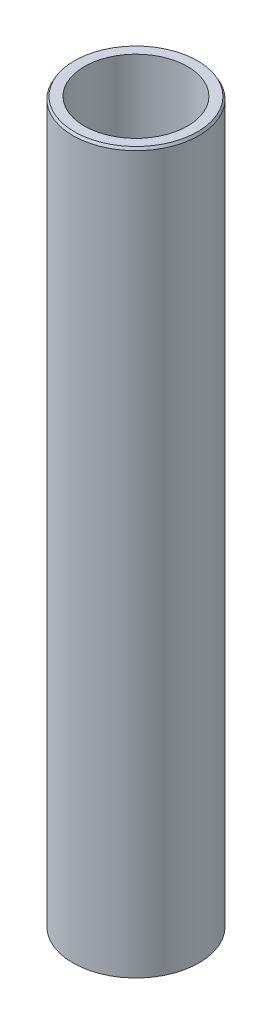
ISO-10303-21;
HEADER;
FILE_DESCRIPTION(('STEP AP214'),'2;1');
FILE_NAME('part.step','',(''),(''),'','','');
FILE_SCHEMA(('AUTOMOTIVE_DESIGN { 1 0 10303 214 1 1 1 1 }'));
ENDSEC;
DATA;
#1=APPLICATION_CONTEXT('core data for automotive mechanical design processes');
#2=APPLICATION_PROTOCOL_DEFINITION('international standard','automotive_design',2000,#1);
#3=PRODUCT_CONTEXT('',#1,'mechanical');
#4=PRODUCT('Part','Part','',(#3));
#5=PRODUCT_RELATED_PRODUCT_CATEGORY('part','',(#4));
#6=PRODUCT_DEFINITION_FORMATION('','',#4);
#7=PRODUCT_DEFINITION_CONTEXT('part definition',#1,'design');
#8=PRODUCT_DEFINITION('design','',#6,#7);
#9=PRODUCT_DEFINITION_SHAPE('','',#8);
#10=(LENGTH_UNIT() NAMED_UNIT(*) SI_UNIT(.MILLI.,.METRE.));
#11=(NAMED_UNIT(*) PLANE_ANGLE_UNIT() SI_UNIT($,.RADIAN.));
#12=(NAMED_UNIT(*) SI_UNIT($,.STERADIAN.) SOLID_ANGLE_UNIT());
#13=UNCERTAINTY_MEASURE_WITH_UNIT(LENGTH_MEASURE(1.E-05),#10,'distance_accuracy_value','');
#14=(GEOMETRIC_REPRESENTATION_CONTEXT(3) GLOBAL_UNCERTAINTY_ASSIGNED_CONTEXT((#13)) GLOBAL_UNIT_ASSIGNED_CONTEXT((#10,
#11,#12)) REPRESENTATION_CONTEXT('',''));
#15=CARTESIAN_POINT('',(0.,0.,0.));
#16=DIRECTION('',(0.,0.,1.));
#17=DIRECTION('',(1.,0.,0.));
#18=AXIS2_PLACEMENT_3D('',#15,#16,#17);
#19=CARTESIAN_POINT('',(0.,600.,0.));
#20=DIRECTION('',(0.,-1.,0.));
#21=DIRECTION('',(0.,0.,-1.));
#22=AXIS2_PLACEMENT_3D('',#19,#20,#21);
#23=CYLINDRICAL_SURFACE('',#22,52.5);
#24=CARTESIAN_POINT('',(0.,597.857189041615,0.));
#25=DIRECTION('',(0.,1.,0.));
#26=DIRECTION('',(0.,0.,1.));
#27=AXIS2_PLACEMENT_3D('',#24,#25,#26);
#28=CIRCLE('',#27,52.5);
#29=CARTESIAN_POINT('',(0.,597.857189041615,52.5));
#30=VERTEX_POINT('',#29);
#31=EDGE_CURVE('E50',#30,#30,#28,.F.);
#32=ORIENTED_EDGE('',*,*,#31,.T.);
#33=EDGE_LOOP('',(#32));
#34=FACE_BOUND('',#33,.T.);
#35=CARTESIAN_POINT('',(0.,1.23715248364575,0.));
#36=DIRECTION('',(0.,1.,0.));
#37=DIRECTION('',(0.,0.,1.));
#38=AXIS2_PLACEMENT_3D('',#35,#36,#37);
#39=CIRCLE('',#38,52.5);
#40=CARTESIAN_POINT('',(0.,1.23715248364575,52.5));
#41=VERTEX_POINT('',#40);
#42=EDGE_CURVE('E51',#41,#41,#39,.T.);
#43=ORIENTED_EDGE('',*,*,#42,.T.);
#44=EDGE_LOOP('',(#43));
#45=FACE_BOUND('',#44,.T.);
#46=ADVANCED_FACE('F39',(#34,#45),#23,.T.);
#47=CARTESIAN_POINT('',(0.,600.,0.));
#48=DIRECTION('',(0.,1.,0.));
#49=DIRECTION('',(0.,0.,1.));
#50=AXIS2_PLACEMENT_3D('',#47,#48,#49);
#51=PLANE('',#50);
#52=CARTESIAN_POINT('',(0.,600.,0.));
#53=DIRECTION('',(0.,1.,0.));
#54=DIRECTION('',(0.,0.,1.));
#55=AXIS2_PLACEMENT_3D('',#52,#53,#54);
#56=CIRCLE('',#55,51.2628475163542);
#57=CARTESIAN_POINT('',(0.,600.,51.2628475163542));
#58=VERTEX_POINT('',#57);
#59=EDGE_CURVE('E54',#58,#58,#56,.T.);
#60=ORIENTED_EDGE('',*,*,#59,.T.);
#61=EDGE_LOOP('',(#60));
#62=FACE_BOUND('',#61,.T.);
#63=CARTESIAN_POINT('',(0.,600.,0.));
#64=DIRECTION('',(0.,1.,0.));
#65=DIRECTION('',(0.,0.,1.));
#66=AXIS2_PLACEMENT_3D('',#63,#64,#65);
#67=CIRCLE('',#66,42.9666730974436);
#68=CARTESIAN_POINT('',(0.,600.,42.9666730974436));
#69=VERTEX_POINT('',#68);
#70=EDGE_CURVE('E58',#69,#69,#67,.T.);
#71=ORIENTED_EDGE('',*,*,#70,.F.);
#72=EDGE_LOOP('',(#71));
#73=FACE_BOUND('',#72,.T.);
#74=ADVANCED_FACE('F69',(#62,#73),#51,.T.);
#75=CARTESIAN_POINT('',(0.,0.,0.));
#76=DIRECTION('',(0.,1.,0.));
#77=DIRECTION('',(0.,0.,1.));
#78=AXIS2_PLACEMENT_3D('',#75,#76,#77);
#79=PLANE('',#78);
#80=CARTESIAN_POINT('',(0.,0.,0.));
#81=DIRECTION('',(0.,1.,0.));
#82=DIRECTION('',(0.,0.,1.));
#83=AXIS2_PLACEMENT_3D('',#80,#81,#82);
#84=CIRCLE('',#83,50.3571890416154);
#85=CARTESIAN_POINT('',(0.,0.,50.3571890416154));
#86=VERTEX_POINT('',#85);
#87=EDGE_CURVE('E10',#86,#86,#84,.F.);
#88=ORIENTED_EDGE('',*,*,#87,.T.);
#89=EDGE_LOOP('',(#88));
#90=FACE_BOUND('',#89,.T.);
#91=CARTESIAN_POINT('',(0.,0.,0.));
#92=DIRECTION('',(0.,1.,0.));
#93=DIRECTION('',(0.,0.,1.));
#94=AXIS2_PLACEMENT_3D('',#91,#92,#93);
#95=CIRCLE('',#94,42.9666730974436);
#96=CARTESIAN_POINT('',(0.,0.,42.9666730974436));
#97=VERTEX_POINT('',#96);
#98=EDGE_CURVE('E63',#97,#97,#95,.T.);
#99=ORIENTED_EDGE('',*,*,#98,.T.);
#100=EDGE_LOOP('',(#99));
#101=FACE_BOUND('',#100,.T.);
#102=ADVANCED_FACE('F75',(#90,#101),#79,.F.);
#103=CARTESIAN_POINT('',(0.,600.,0.));
#104=DIRECTION('',(0.,-1.,0.));
#105=DIRECTION('',(0.,0.,-1.));
#106=AXIS2_PLACEMENT_3D('',#103,#104,#105);
#107=CYLINDRICAL_SURFACE('',#106,42.9666730974436);
#108=ORIENTED_EDGE('',*,*,#70,.T.);
#109=EDGE_LOOP('',(#108));
#110=FACE_BOUND('',#109,.T.);
#111=ORIENTED_EDGE('',*,*,#98,.F.);
#112=EDGE_LOOP('',(#111));
#113=FACE_BOUND('',#112,.T.);
#114=ADVANCED_FACE('F70',(#110,#113),#107,.F.);
#115=CARTESIAN_POINT('',(0.,600.,0.));
#116=DIRECTION('',(0.,-1.,0.));
#117=DIRECTION('',(0.,0.,-1.));
#118=AXIS2_PLACEMENT_3D('',#115,#116,#117);
#119=CONICAL_SURFACE('',#118,51.2628475163542,0.523598775598308);
#120=ORIENTED_EDGE('',*,*,#31,.F.);
#121=EDGE_LOOP('',(#120));
#122=FACE_BOUND('',#121,.T.);
#123=ORIENTED_EDGE('',*,*,#59,.F.);
#124=EDGE_LOOP('',(#123));
#125=FACE_BOUND('',#124,.T.);
#126=ADVANCED_FACE('F81',(#122,#125),#119,.T.);
#127=CARTESIAN_POINT('',(0.,1.23715248364575,0.));
#128=DIRECTION('',(0.,1.,0.));
#129=DIRECTION('',(0.,0.,1.));
#130=AXIS2_PLACEMENT_3D('',#127,#128,#129);
#131=CONICAL_SURFACE('',#130,52.5,1.04719755119662);
#132=ORIENTED_EDGE('',*,*,#87,.F.);
#133=EDGE_LOOP('',(#132));
#134=FACE_BOUND('',#133,.T.);
#135=ORIENTED_EDGE('',*,*,#42,.F.);
#136=EDGE_LOOP('',(#135));
#137=FACE_BOUND('',#136,.T.);
#138=ADVANCED_FACE('F45',(#134,#137),#131,.T.);
#139=CLOSED_SHELL('',(#46,#74,#102,#114,#126,#138));
#140=MANIFOLD_SOLID_BREP('B2',#139);
#141=ADVANCED_BREP_SHAPE_REPRESENTATION('',(#18,#140),#14);
#142=SHAPE_DEFINITION_REPRESENTATION(#9,#141);
ENDSEC;
END-ISO-10303-21;
